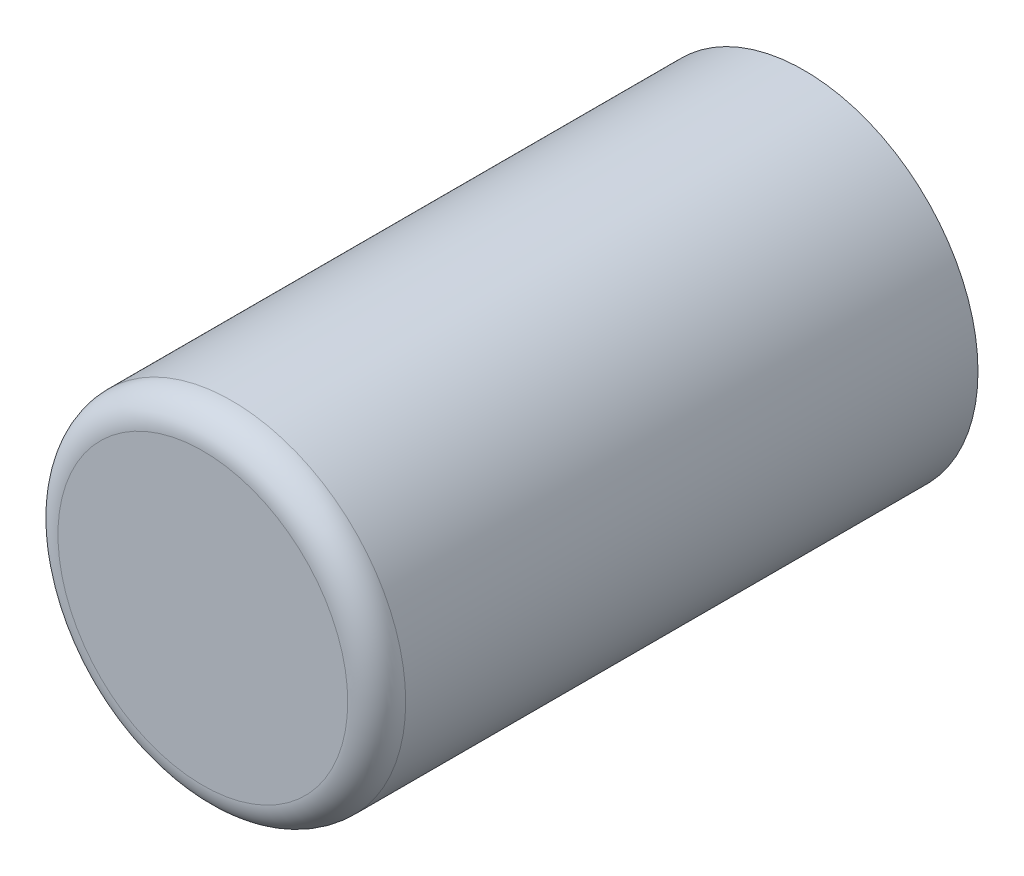
ISO-10303-21;
HEADER;
FILE_DESCRIPTION(('STEP AP214'),'2;1');
FILE_NAME('part.step','',(''),(''),'','','');
FILE_SCHEMA(('AUTOMOTIVE_DESIGN { 1 0 10303 214 1 1 1 1 }'));
ENDSEC;
DATA;
#1=APPLICATION_CONTEXT('core data for automotive mechanical design processes');
#2=APPLICATION_PROTOCOL_DEFINITION('international standard','automotive_design',2000,#1);
#3=PRODUCT_CONTEXT('',#1,'mechanical');
#4=PRODUCT('Part','Part','',(#3));
#5=PRODUCT_RELATED_PRODUCT_CATEGORY('part','',(#4));
#6=PRODUCT_DEFINITION_FORMATION('','',#4);
#7=PRODUCT_DEFINITION_CONTEXT('part definition',#1,'design');
#8=PRODUCT_DEFINITION('design','',#6,#7);
#9=PRODUCT_DEFINITION_SHAPE('','',#8);
#10=(LENGTH_UNIT() NAMED_UNIT(*) SI_UNIT(.MILLI.,.METRE.));
#11=(NAMED_UNIT(*) PLANE_ANGLE_UNIT() SI_UNIT($,.RADIAN.));
#12=(NAMED_UNIT(*) SI_UNIT($,.STERADIAN.) SOLID_ANGLE_UNIT());
#13=UNCERTAINTY_MEASURE_WITH_UNIT(LENGTH_MEASURE(1.E-05),#10,'distance_accuracy_value','');
#14=(GEOMETRIC_REPRESENTATION_CONTEXT(3) GLOBAL_UNCERTAINTY_ASSIGNED_CONTEXT((#13)) GLOBAL_UNIT_ASSIGNED_CONTEXT((#10,
#11,#12)) REPRESENTATION_CONTEXT('',''));
#15=CARTESIAN_POINT('',(0.,0.,0.));
#16=DIRECTION('',(0.,0.,1.));
#17=DIRECTION('',(1.,0.,0.));
#18=AXIS2_PLACEMENT_3D('',#15,#16,#17);
#19=CARTESIAN_POINT('',(0.,0.,83.));
#20=DIRECTION('',(0.,0.,-1.));
#21=DIRECTION('',(-1.,0.,0.));
#22=AXIS2_PLACEMENT_3D('',#19,#20,#21);
#23=CYLINDRICAL_SURFACE('',#22,24.);
#24=CARTESIAN_POINT('',(0.,0.,79.));
#25=DIRECTION('',(0.,0.,1.));
#26=DIRECTION('',(1.,0.,0.));
#27=AXIS2_PLACEMENT_3D('',#24,#25,#26);
#28=CIRCLE('',#27,24.);
#29=CARTESIAN_POINT('',(24.,0.,79.));
#30=VERTEX_POINT('',#29);
#31=EDGE_CURVE('E10',#30,#30,#28,.F.);
#32=ORIENTED_EDGE('',*,*,#31,.T.);
#33=EDGE_LOOP('',(#32));
#34=FACE_BOUND('',#33,.T.);
#35=CARTESIAN_POINT('',(0.,0.,0.));
#36=DIRECTION('',(0.,0.,1.));
#37=DIRECTION('',(1.,0.,0.));
#38=AXIS2_PLACEMENT_3D('',#35,#36,#37);
#39=CIRCLE('',#38,24.);
#40=CARTESIAN_POINT('',(24.,0.,0.));
#41=VERTEX_POINT('',#40);
#42=EDGE_CURVE('E63',#41,#41,#39,.T.);
#43=ORIENTED_EDGE('',*,*,#42,.T.);
#44=EDGE_LOOP('',(#43));
#45=FACE_BOUND('',#44,.T.);
#46=ADVANCED_FACE('F47',(#34,#45),#23,.T.);
#47=CARTESIAN_POINT('',(0.,0.,83.));
#48=DIRECTION('',(0.,0.,1.));
#49=DIRECTION('',(1.,0.,0.));
#50=AXIS2_PLACEMENT_3D('',#47,#48,#49);
#51=PLANE('',#50);
#52=CARTESIAN_POINT('',(0.,0.,83.));
#53=DIRECTION('',(0.,0.,1.));
#54=DIRECTION('',(1.,0.,0.));
#55=AXIS2_PLACEMENT_3D('',#52,#53,#54);
#56=CIRCLE('',#55,20.);
#57=CARTESIAN_POINT('',(20.,0.,83.));
#58=VERTEX_POINT('',#57);
#59=EDGE_CURVE('E55',#58,#58,#56,.T.);
#60=ORIENTED_EDGE('',*,*,#59,.T.);
#61=EDGE_LOOP('',(#60));
#62=FACE_BOUND('',#61,.T.);
#63=ADVANCED_FACE('F96',(#62),#51,.T.);
#64=CARTESIAN_POINT('',(0.,0.,0.));
#65=DIRECTION('',(0.,0.,1.));
#66=DIRECTION('',(1.,0.,0.));
#67=AXIS2_PLACEMENT_3D('',#64,#65,#66);
#68=PLANE('',#67);
#69=CARTESIAN_POINT('',(0.,0.,0.));
#70=DIRECTION('',(0.,0.,1.));
#71=DIRECTION('',(1.,0.,0.));
#72=AXIS2_PLACEMENT_3D('',#69,#70,#71);
#73=CIRCLE('',#72,23.5);
#74=CARTESIAN_POINT('',(23.5,0.,0.));
#75=VERTEX_POINT('',#74);
#76=EDGE_CURVE('E73',#75,#75,#73,.T.);
#77=ORIENTED_EDGE('',*,*,#76,.T.);
#78=EDGE_LOOP('',(#77));
#79=FACE_BOUND('',#78,.T.);
#80=ORIENTED_EDGE('',*,*,#42,.F.);
#81=EDGE_LOOP('',(#80));
#82=FACE_BOUND('',#81,.T.);
#83=ADVANCED_FACE('F93',(#79,#82),#68,.F.);
#84=CARTESIAN_POINT('',(0.,0.,79.));
#85=DIRECTION('',(0.,0.,1.));
#86=DIRECTION('',(1.,0.,0.));
#87=AXIS2_PLACEMENT_3D('',#84,#85,#86);
#88=TOROIDAL_SURFACE('',#87,20.,4.);
#89=ORIENTED_EDGE('',*,*,#31,.F.);
#90=EDGE_LOOP('',(#89));
#91=FACE_BOUND('',#90,.T.);
#92=ORIENTED_EDGE('',*,*,#59,.F.);
#93=EDGE_LOOP('',(#92));
#94=FACE_BOUND('',#93,.T.);
#95=ADVANCED_FACE('F49',(#91,#94),#88,.T.);
#96=CARTESIAN_POINT('',(0.,0.,83.));
#97=DIRECTION('',(0.,0.,-1.));
#98=DIRECTION('',(-1.,0.,0.));
#99=AXIS2_PLACEMENT_3D('',#96,#97,#98);
#100=CYLINDRICAL_SURFACE('',#99,23.5);
#101=CARTESIAN_POINT('',(0.,0.,79.));
#102=DIRECTION('',(0.,0.,-1.));
#103=DIRECTION('',(-1.,0.,0.));
#104=AXIS2_PLACEMENT_3D('',#101,#102,#103);
#105=CIRCLE('',#104,23.5);
#106=CARTESIAN_POINT('',(-23.5,0.,79.));
#107=VERTEX_POINT('',#106);
#108=EDGE_CURVE('E70',#107,#107,#105,.T.);
#109=ORIENTED_EDGE('',*,*,#108,.F.);
#110=EDGE_LOOP('',(#109));
#111=FACE_BOUND('',#110,.T.);
#112=ORIENTED_EDGE('',*,*,#76,.F.);
#113=EDGE_LOOP('',(#112));
#114=FACE_BOUND('',#113,.T.);
#115=ADVANCED_FACE('F86',(#111,#114),#100,.F.);
#116=CARTESIAN_POINT('',(0.,0.,82.5));
#117=DIRECTION('',(0.,0.,1.));
#118=DIRECTION('',(1.,0.,0.));
#119=AXIS2_PLACEMENT_3D('',#116,#117,#118);
#120=PLANE('',#119);
#121=CARTESIAN_POINT('',(0.,0.,82.5));
#122=DIRECTION('',(0.,0.,1.));
#123=DIRECTION('',(1.,0.,0.));
#124=AXIS2_PLACEMENT_3D('',#121,#122,#123);
#125=CIRCLE('',#124,20.);
#126=CARTESIAN_POINT('',(20.,0.,82.5));
#127=VERTEX_POINT('',#126);
#128=EDGE_CURVE('E76',#127,#127,#125,.T.);
#129=ORIENTED_EDGE('',*,*,#128,.F.);
#130=EDGE_LOOP('',(#129));
#131=FACE_BOUND('',#130,.T.);
#132=ADVANCED_FACE('F89',(#131),#120,.F.);
#133=CARTESIAN_POINT('',(0.,0.,79.));
#134=DIRECTION('',(0.,0.,1.));
#135=DIRECTION('',(1.,0.,0.));
#136=AXIS2_PLACEMENT_3D('',#133,#134,#135);
#137=TOROIDAL_SURFACE('',#136,20.,3.5);
#138=ORIENTED_EDGE('',*,*,#108,.T.);
#139=EDGE_LOOP('',(#138));
#140=FACE_BOUND('',#139,.T.);
#141=ORIENTED_EDGE('',*,*,#128,.T.);
#142=EDGE_LOOP('',(#141));
#143=FACE_BOUND('',#142,.T.);
#144=ADVANCED_FACE('F83',(#140,#143),#137,.F.);
#145=CLOSED_SHELL('',(#46,#63,#83,#95,#115,#132,#144));
#146=MANIFOLD_SOLID_BREP('B2',#145);
#147=ADVANCED_BREP_SHAPE_REPRESENTATION('',(#18,#146),#14);
#148=SHAPE_DEFINITION_REPRESENTATION(#9,#147);
ENDSEC;
END-ISO-10303-21;
